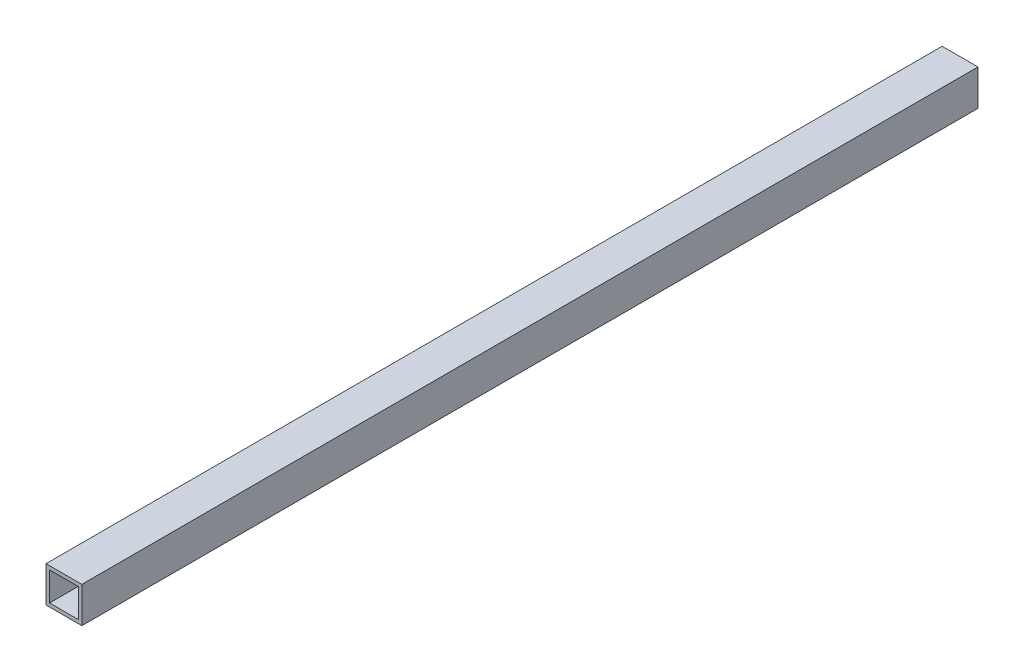
ISO-10303-21;
HEADER;
FILE_DESCRIPTION(('STEP AP214'),'2;1');
FILE_NAME('part.step','',(''),(''),'','','');
FILE_SCHEMA(('AUTOMOTIVE_DESIGN { 1 0 10303 214 1 1 1 1 }'));
ENDSEC;
DATA;
#1=APPLICATION_CONTEXT('core data for automotive mechanical design processes');
#2=APPLICATION_PROTOCOL_DEFINITION('international standard','automotive_design',2000,#1);
#3=PRODUCT_CONTEXT('',#1,'mechanical');
#4=PRODUCT('Part','Part','',(#3));
#5=PRODUCT_RELATED_PRODUCT_CATEGORY('part','',(#4));
#6=PRODUCT_DEFINITION_FORMATION('','',#4);
#7=PRODUCT_DEFINITION_CONTEXT('part definition',#1,'design');
#8=PRODUCT_DEFINITION('design','',#6,#7);
#9=PRODUCT_DEFINITION_SHAPE('','',#8);
#10=(LENGTH_UNIT() NAMED_UNIT(*) SI_UNIT(.MILLI.,.METRE.));
#11=(NAMED_UNIT(*) PLANE_ANGLE_UNIT() SI_UNIT($,.RADIAN.));
#12=(NAMED_UNIT(*) SI_UNIT($,.STERADIAN.) SOLID_ANGLE_UNIT());
#13=UNCERTAINTY_MEASURE_WITH_UNIT(LENGTH_MEASURE(1.E-05),#10,'distance_accuracy_value','');
#14=(GEOMETRIC_REPRESENTATION_CONTEXT(3) GLOBAL_UNCERTAINTY_ASSIGNED_CONTEXT((#13)) GLOBAL_UNIT_ASSIGNED_CONTEXT((#10,
#11,#12)) REPRESENTATION_CONTEXT('',''));
#15=CARTESIAN_POINT('',(0.,0.,0.));
#16=DIRECTION('',(0.,0.,1.));
#17=DIRECTION('',(1.,0.,0.));
#18=AXIS2_PLACEMENT_3D('',#15,#16,#17);
#19=CARTESIAN_POINT('',(0.,0.,-1000.));
#20=DIRECTION('',(-1.,0.,0.));
#21=DIRECTION('',(0.,0.,1.));
#22=AXIS2_PLACEMENT_3D('',#19,#20,#21);
#23=PLANE('',#22);
#24=DIRECTION('',(0.,-1.,0.));
#25=VECTOR('',#24,1.);
#26=CARTESIAN_POINT('',(0.,0.,0.));
#27=LINE('',#26,#25);
#28=CARTESIAN_POINT('',(0.,40.,0.));
#29=VERTEX_POINT('',#28);
#30=CARTESIAN_POINT('',(0.,0.,0.));
#31=VERTEX_POINT('',#30);
#32=EDGE_CURVE('E135',#29,#31,#27,.T.);
#33=ORIENTED_EDGE('',*,*,#32,.F.);
#34=DIRECTION('',(0.,0.,1.));
#35=VECTOR('',#34,1.);
#36=CARTESIAN_POINT('',(0.,40.,-1000.));
#37=LINE('',#36,#35);
#38=CARTESIAN_POINT('',(0.,40.,-1000.));
#39=VERTEX_POINT('',#38);
#40=EDGE_CURVE('E11',#39,#29,#37,.T.);
#41=ORIENTED_EDGE('',*,*,#40,.F.);
#42=DIRECTION('',(0.,-1.,0.));
#43=VECTOR('',#42,1.);
#44=CARTESIAN_POINT('',(0.,0.,-1000.));
#45=LINE('',#44,#43);
#46=CARTESIAN_POINT('',(0.,0.,-1000.));
#47=VERTEX_POINT('',#46);
#48=EDGE_CURVE('E139',#39,#47,#45,.T.);
#49=ORIENTED_EDGE('',*,*,#48,.T.);
#50=DIRECTION('',(0.,0.,1.));
#51=VECTOR('',#50,1.);
#52=CARTESIAN_POINT('',(0.,0.,-1000.));
#53=LINE('',#52,#51);
#54=EDGE_CURVE('E40',#47,#31,#53,.T.);
#55=ORIENTED_EDGE('',*,*,#54,.T.);
#56=EDGE_LOOP('',(#33,#41,#49,#55));
#57=FACE_BOUND('',#56,.T.);
#58=ADVANCED_FACE('F37',(#57),#23,.T.);
#59=CARTESIAN_POINT('',(0.,40.,-1000.));
#60=DIRECTION('',(0.,1.,0.));
#61=DIRECTION('',(0.,0.,1.));
#62=AXIS2_PLACEMENT_3D('',#59,#60,#61);
#63=PLANE('',#62);
#64=DIRECTION('',(-1.,0.,0.));
#65=VECTOR('',#64,1.);
#66=CARTESIAN_POINT('',(0.,40.,0.));
#67=LINE('',#66,#65);
#68=CARTESIAN_POINT('',(40.,40.,0.));
#69=VERTEX_POINT('',#68);
#70=EDGE_CURVE('E143',#69,#29,#67,.T.);
#71=ORIENTED_EDGE('',*,*,#70,.F.);
#72=DIRECTION('',(0.,0.,1.));
#73=VECTOR('',#72,1.);
#74=CARTESIAN_POINT('',(40.,40.,-1000.));
#75=LINE('',#74,#73);
#76=CARTESIAN_POINT('',(40.,40.,-1000.));
#77=VERTEX_POINT('',#76);
#78=EDGE_CURVE('E45',#77,#69,#75,.T.);
#79=ORIENTED_EDGE('',*,*,#78,.F.);
#80=DIRECTION('',(-1.,0.,0.));
#81=VECTOR('',#80,1.);
#82=CARTESIAN_POINT('',(0.,40.,-1000.));
#83=LINE('',#82,#81);
#84=EDGE_CURVE('E149',#77,#39,#83,.T.);
#85=ORIENTED_EDGE('',*,*,#84,.T.);
#86=ORIENTED_EDGE('',*,*,#40,.T.);
#87=EDGE_LOOP('',(#71,#79,#85,#86));
#88=FACE_BOUND('',#87,.T.);
#89=ADVANCED_FACE('F175',(#88),#63,.T.);
#90=CARTESIAN_POINT('',(40.,0.,-1000.));
#91=DIRECTION('',(1.,0.,0.));
#92=DIRECTION('',(0.,0.,-1.));
#93=AXIS2_PLACEMENT_3D('',#90,#91,#92);
#94=PLANE('',#93);
#95=DIRECTION('',(0.,1.,0.));
#96=VECTOR('',#95,1.);
#97=CARTESIAN_POINT('',(40.,0.,0.));
#98=LINE('',#97,#96);
#99=CARTESIAN_POINT('',(40.,0.,0.));
#100=VERTEX_POINT('',#99);
#101=EDGE_CURVE('E157',#100,#69,#98,.T.);
#102=ORIENTED_EDGE('',*,*,#101,.F.);
#103=DIRECTION('',(0.,0.,1.));
#104=VECTOR('',#103,1.);
#105=CARTESIAN_POINT('',(40.,0.,-1000.));
#106=LINE('',#105,#104);
#107=CARTESIAN_POINT('',(40.,0.,-1000.));
#108=VERTEX_POINT('',#107);
#109=EDGE_CURVE('E162',#108,#100,#106,.T.);
#110=ORIENTED_EDGE('',*,*,#109,.F.);
#111=DIRECTION('',(0.,1.,0.));
#112=VECTOR('',#111,1.);
#113=CARTESIAN_POINT('',(40.,0.,-1000.));
#114=LINE('',#113,#112);
#115=EDGE_CURVE('E146',#108,#77,#114,.T.);
#116=ORIENTED_EDGE('',*,*,#115,.T.);
#117=ORIENTED_EDGE('',*,*,#78,.T.);
#118=EDGE_LOOP('',(#102,#110,#116,#117));
#119=FACE_BOUND('',#118,.T.);
#120=ADVANCED_FACE('F179',(#119),#94,.T.);
#121=CARTESIAN_POINT('',(0.,0.,-1000.));
#122=DIRECTION('',(0.,-1.,0.));
#123=DIRECTION('',(0.,0.,-1.));
#124=AXIS2_PLACEMENT_3D('',#121,#122,#123);
#125=PLANE('',#124);
#126=DIRECTION('',(1.,0.,0.));
#127=VECTOR('',#126,1.);
#128=CARTESIAN_POINT('',(0.,0.,0.));
#129=LINE('',#128,#127);
#130=EDGE_CURVE('E154',#31,#100,#129,.T.);
#131=ORIENTED_EDGE('',*,*,#130,.F.);
#132=ORIENTED_EDGE('',*,*,#54,.F.);
#133=DIRECTION('',(1.,0.,0.));
#134=VECTOR('',#133,1.);
#135=CARTESIAN_POINT('',(0.,0.,-1000.));
#136=LINE('',#135,#134);
#137=EDGE_CURVE('E142',#47,#108,#136,.T.);
#138=ORIENTED_EDGE('',*,*,#137,.T.);
#139=ORIENTED_EDGE('',*,*,#109,.T.);
#140=EDGE_LOOP('',(#131,#132,#138,#139));
#141=FACE_BOUND('',#140,.T.);
#142=ADVANCED_FACE('F170',(#141),#125,.T.);
#143=CARTESIAN_POINT('',(0.,0.,-1000.));
#144=DIRECTION('',(0.,0.,-1.));
#145=DIRECTION('',(-1.,0.,0.));
#146=AXIS2_PLACEMENT_3D('',#143,#144,#145);
#147=PLANE('',#146);
#148=DIRECTION('',(0.,-1.,0.));
#149=VECTOR('',#148,1.);
#150=CARTESIAN_POINT('',(4.,4.,-1000.));
#151=LINE('',#150,#149);
#152=CARTESIAN_POINT('',(4.,36.,-1000.));
#153=VERTEX_POINT('',#152);
#154=CARTESIAN_POINT('',(4.,4.,-1000.));
#155=VERTEX_POINT('',#154);
#156=EDGE_CURVE('E104',#153,#155,#151,.T.);
#157=ORIENTED_EDGE('',*,*,#156,.T.);
#158=DIRECTION('',(1.,0.,0.));
#159=VECTOR('',#158,1.);
#160=CARTESIAN_POINT('',(4.,4.,-1000.));
#161=LINE('',#160,#159);
#162=CARTESIAN_POINT('',(36.,4.,-1000.));
#163=VERTEX_POINT('',#162);
#164=EDGE_CURVE('E113',#155,#163,#161,.T.);
#165=ORIENTED_EDGE('',*,*,#164,.T.);
#166=DIRECTION('',(0.,1.,0.));
#167=VECTOR('',#166,1.);
#168=CARTESIAN_POINT('',(36.,4.,-1000.));
#169=LINE('',#168,#167);
#170=CARTESIAN_POINT('',(36.,36.,-1000.));
#171=VERTEX_POINT('',#170);
#172=EDGE_CURVE('E53',#163,#171,#169,.T.);
#173=ORIENTED_EDGE('',*,*,#172,.T.);
#174=DIRECTION('',(-1.,0.,0.));
#175=VECTOR('',#174,1.);
#176=CARTESIAN_POINT('',(4.,36.,-1000.));
#177=LINE('',#176,#175);
#178=EDGE_CURVE('E110',#171,#153,#177,.T.);
#179=ORIENTED_EDGE('',*,*,#178,.T.);
#180=EDGE_LOOP('',(#157,#165,#173,#179));
#181=FACE_BOUND('',#180,.T.);
#182=ORIENTED_EDGE('',*,*,#48,.F.);
#183=ORIENTED_EDGE('',*,*,#84,.F.);
#184=ORIENTED_EDGE('',*,*,#115,.F.);
#185=ORIENTED_EDGE('',*,*,#137,.F.);
#186=EDGE_LOOP('',(#182,#183,#184,#185));
#187=FACE_BOUND('',#186,.T.);
#188=ADVANCED_FACE('F117',(#181,#187),#147,.T.);
#189=CARTESIAN_POINT('',(0.,0.,0.));
#190=DIRECTION('',(0.,0.,-1.));
#191=DIRECTION('',(-1.,0.,0.));
#192=AXIS2_PLACEMENT_3D('',#189,#190,#191);
#193=PLANE('',#192);
#194=DIRECTION('',(1.,0.,0.));
#195=VECTOR('',#194,1.);
#196=CARTESIAN_POINT('',(4.,4.,0.));
#197=LINE('',#196,#195);
#198=CARTESIAN_POINT('',(4.,4.,0.));
#199=VERTEX_POINT('',#198);
#200=CARTESIAN_POINT('',(36.,4.,0.));
#201=VERTEX_POINT('',#200);
#202=EDGE_CURVE('E129',#199,#201,#197,.T.);
#203=ORIENTED_EDGE('',*,*,#202,.F.);
#204=DIRECTION('',(0.,-1.,0.));
#205=VECTOR('',#204,1.);
#206=CARTESIAN_POINT('',(4.,4.,0.));
#207=LINE('',#206,#205);
#208=CARTESIAN_POINT('',(4.,36.,0.));
#209=VERTEX_POINT('',#208);
#210=EDGE_CURVE('E61',#209,#199,#207,.T.);
#211=ORIENTED_EDGE('',*,*,#210,.F.);
#212=DIRECTION('',(-1.,0.,0.));
#213=VECTOR('',#212,1.);
#214=CARTESIAN_POINT('',(4.,36.,0.));
#215=LINE('',#214,#213);
#216=CARTESIAN_POINT('',(36.,36.,0.));
#217=VERTEX_POINT('',#216);
#218=EDGE_CURVE('E120',#217,#209,#215,.T.);
#219=ORIENTED_EDGE('',*,*,#218,.F.);
#220=DIRECTION('',(0.,1.,0.));
#221=VECTOR('',#220,1.);
#222=CARTESIAN_POINT('',(36.,4.,0.));
#223=LINE('',#222,#221);
#224=EDGE_CURVE('E123',#201,#217,#223,.T.);
#225=ORIENTED_EDGE('',*,*,#224,.F.);
#226=EDGE_LOOP('',(#203,#211,#219,#225));
#227=FACE_BOUND('',#226,.T.);
#228=ORIENTED_EDGE('',*,*,#32,.T.);
#229=ORIENTED_EDGE('',*,*,#130,.T.);
#230=ORIENTED_EDGE('',*,*,#101,.T.);
#231=ORIENTED_EDGE('',*,*,#70,.T.);
#232=EDGE_LOOP('',(#228,#229,#230,#231));
#233=FACE_BOUND('',#232,.T.);
#234=ADVANCED_FACE('F172',(#227,#233),#193,.F.);
#235=CARTESIAN_POINT('',(4.,4.,-1000.));
#236=DIRECTION('',(-1.,0.,0.));
#237=DIRECTION('',(0.,0.,1.));
#238=AXIS2_PLACEMENT_3D('',#235,#236,#237);
#239=PLANE('',#238);
#240=ORIENTED_EDGE('',*,*,#210,.T.);
#241=DIRECTION('',(0.,0.,1.));
#242=VECTOR('',#241,1.);
#243=CARTESIAN_POINT('',(4.,4.,-1000.));
#244=LINE('',#243,#242);
#245=EDGE_CURVE('E100',#155,#199,#244,.T.);
#246=ORIENTED_EDGE('',*,*,#245,.F.);
#247=ORIENTED_EDGE('',*,*,#156,.F.);
#248=DIRECTION('',(0.,0.,1.));
#249=VECTOR('',#248,1.);
#250=CARTESIAN_POINT('',(4.,36.,-1000.));
#251=LINE('',#250,#249);
#252=EDGE_CURVE('E133',#153,#209,#251,.T.);
#253=ORIENTED_EDGE('',*,*,#252,.T.);
#254=EDGE_LOOP('',(#240,#246,#247,#253));
#255=FACE_BOUND('',#254,.T.);
#256=ADVANCED_FACE('F102',(#255),#239,.F.);
#257=CARTESIAN_POINT('',(4.,36.,-1000.));
#258=DIRECTION('',(0.,1.,0.));
#259=DIRECTION('',(0.,0.,1.));
#260=AXIS2_PLACEMENT_3D('',#257,#258,#259);
#261=PLANE('',#260);
#262=ORIENTED_EDGE('',*,*,#218,.T.);
#263=ORIENTED_EDGE('',*,*,#252,.F.);
#264=ORIENTED_EDGE('',*,*,#178,.F.);
#265=DIRECTION('',(0.,0.,1.));
#266=VECTOR('',#265,1.);
#267=CARTESIAN_POINT('',(36.,36.,-1000.));
#268=LINE('',#267,#266);
#269=EDGE_CURVE('E136',#171,#217,#268,.T.);
#270=ORIENTED_EDGE('',*,*,#269,.T.);
#271=EDGE_LOOP('',(#262,#263,#264,#270));
#272=FACE_BOUND('',#271,.T.);
#273=ADVANCED_FACE('F235',(#272),#261,.F.);
#274=CARTESIAN_POINT('',(36.,4.,-1000.));
#275=DIRECTION('',(1.,0.,0.));
#276=DIRECTION('',(0.,0.,-1.));
#277=AXIS2_PLACEMENT_3D('',#274,#275,#276);
#278=PLANE('',#277);
#279=ORIENTED_EDGE('',*,*,#224,.T.);
#280=ORIENTED_EDGE('',*,*,#269,.F.);
#281=ORIENTED_EDGE('',*,*,#172,.F.);
#282=DIRECTION('',(0.,0.,1.));
#283=VECTOR('',#282,1.);
#284=CARTESIAN_POINT('',(36.,4.,-1000.));
#285=LINE('',#284,#283);
#286=EDGE_CURVE('E109',#163,#201,#285,.T.);
#287=ORIENTED_EDGE('',*,*,#286,.T.);
#288=EDGE_LOOP('',(#279,#280,#281,#287));
#289=FACE_BOUND('',#288,.T.);
#290=ADVANCED_FACE('F245',(#289),#278,.F.);
#291=CARTESIAN_POINT('',(4.,4.,-1000.));
#292=DIRECTION('',(0.,-1.,0.));
#293=DIRECTION('',(0.,0.,-1.));
#294=AXIS2_PLACEMENT_3D('',#291,#292,#293);
#295=PLANE('',#294);
#296=ORIENTED_EDGE('',*,*,#202,.T.);
#297=ORIENTED_EDGE('',*,*,#286,.F.);
#298=ORIENTED_EDGE('',*,*,#164,.F.);
#299=ORIENTED_EDGE('',*,*,#245,.T.);
#300=EDGE_LOOP('',(#296,#297,#298,#299));
#301=FACE_BOUND('',#300,.T.);
#302=ADVANCED_FACE('F114',(#301),#295,.F.);
#303=CLOSED_SHELL('',(#58,#89,#120,#142,#188,#234,#256,#273,#290,#302));
#304=MANIFOLD_SOLID_BREP('B2',#303);
#305=ADVANCED_BREP_SHAPE_REPRESENTATION('',(#18,#304),#14);
#306=SHAPE_DEFINITION_REPRESENTATION(#9,#305);
ENDSEC;
END-ISO-10303-21;
